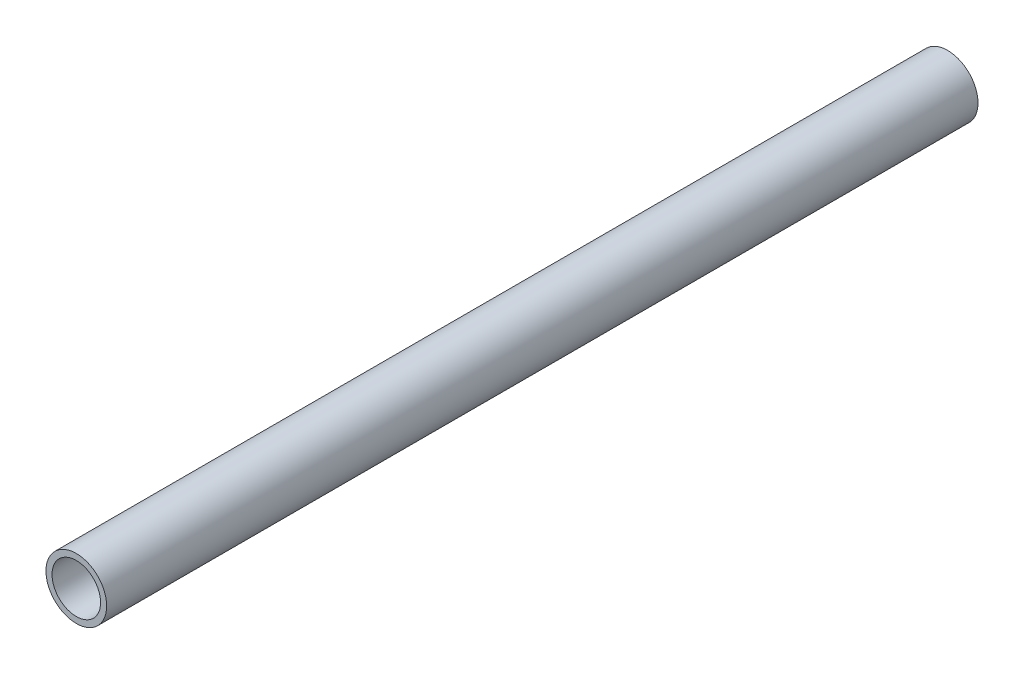
ISO-10303-21;
HEADER;
FILE_DESCRIPTION(('STEP AP214'),'2;1');
FILE_NAME('part.step','',(''),(''),'','','');
FILE_SCHEMA(('AUTOMOTIVE_DESIGN { 1 0 10303 214 1 1 1 1 }'));
ENDSEC;
DATA;
#1=APPLICATION_CONTEXT('core data for automotive mechanical design processes');
#2=APPLICATION_PROTOCOL_DEFINITION('international standard','automotive_design',2000,#1);
#3=PRODUCT_CONTEXT('',#1,'mechanical');
#4=PRODUCT('Part','Part','',(#3));
#5=PRODUCT_RELATED_PRODUCT_CATEGORY('part','',(#4));
#6=PRODUCT_DEFINITION_FORMATION('','',#4);
#7=PRODUCT_DEFINITION_CONTEXT('part definition',#1,'design');
#8=PRODUCT_DEFINITION('design','',#6,#7);
#9=PRODUCT_DEFINITION_SHAPE('','',#8);
#10=(LENGTH_UNIT() NAMED_UNIT(*) SI_UNIT(.MILLI.,.METRE.));
#11=(NAMED_UNIT(*) PLANE_ANGLE_UNIT() SI_UNIT($,.RADIAN.));
#12=(NAMED_UNIT(*) SI_UNIT($,.STERADIAN.) SOLID_ANGLE_UNIT());
#13=UNCERTAINTY_MEASURE_WITH_UNIT(LENGTH_MEASURE(1.E-05),#10,'distance_accuracy_value','');
#14=(GEOMETRIC_REPRESENTATION_CONTEXT(3) GLOBAL_UNCERTAINTY_ASSIGNED_CONTEXT((#13)) GLOBAL_UNIT_ASSIGNED_CONTEXT((#10,
#11,#12)) REPRESENTATION_CONTEXT('',''));
#15=CARTESIAN_POINT('',(0.,0.,0.));
#16=DIRECTION('',(0.,0.,1.));
#17=DIRECTION('',(1.,0.,0.));
#18=AXIS2_PLACEMENT_3D('',#15,#16,#17);
#19=CARTESIAN_POINT('',(0.,0.,143.5));
#20=DIRECTION('',(0.,0.,1.));
#21=DIRECTION('',(1.,0.,0.));
#22=AXIS2_PLACEMENT_3D('',#19,#20,#21);
#23=PLANE('',#22);
#24=CARTESIAN_POINT('',(0.,0.,143.5));
#25=DIRECTION('',(0.,0.,1.));
#26=DIRECTION('',(1.,0.,0.));
#27=AXIS2_PLACEMENT_3D('',#24,#25,#26);
#28=CIRCLE('',#27,5.);
#29=CARTESIAN_POINT('',(5.,0.,143.5));
#30=VERTEX_POINT('',#29);
#31=EDGE_CURVE('E10',#30,#30,#28,.T.);
#32=ORIENTED_EDGE('',*,*,#31,.T.);
#33=EDGE_LOOP('',(#32));
#34=FACE_BOUND('',#33,.T.);
#35=CARTESIAN_POINT('',(0.,0.,143.5));
#36=DIRECTION('',(0.,0.,1.));
#37=DIRECTION('',(1.,0.,0.));
#38=AXIS2_PLACEMENT_3D('',#35,#36,#37);
#39=CIRCLE('',#38,4.);
#40=CARTESIAN_POINT('',(4.,0.,143.5));
#41=VERTEX_POINT('',#40);
#42=EDGE_CURVE('E44',#41,#41,#39,.T.);
#43=ORIENTED_EDGE('',*,*,#42,.F.);
#44=EDGE_LOOP('',(#43));
#45=FACE_BOUND('',#44,.T.);
#46=ADVANCED_FACE('F33',(#34,#45),#23,.T.);
#47=CARTESIAN_POINT('',(0.,0.,0.));
#48=DIRECTION('',(0.,0.,1.));
#49=DIRECTION('',(1.,0.,0.));
#50=AXIS2_PLACEMENT_3D('',#47,#48,#49);
#51=PLANE('',#50);
#52=CARTESIAN_POINT('',(0.,0.,0.));
#53=DIRECTION('',(0.,0.,1.));
#54=DIRECTION('',(1.,0.,0.));
#55=AXIS2_PLACEMENT_3D('',#52,#53,#54);
#56=CIRCLE('',#55,5.);
#57=CARTESIAN_POINT('',(5.,0.,0.));
#58=VERTEX_POINT('',#57);
#59=EDGE_CURVE('E37',#58,#58,#56,.T.);
#60=ORIENTED_EDGE('',*,*,#59,.F.);
#61=EDGE_LOOP('',(#60));
#62=FACE_BOUND('',#61,.T.);
#63=CARTESIAN_POINT('',(0.,0.,0.));
#64=DIRECTION('',(0.,0.,1.));
#65=DIRECTION('',(1.,0.,0.));
#66=AXIS2_PLACEMENT_3D('',#63,#64,#65);
#67=CIRCLE('',#66,4.);
#68=CARTESIAN_POINT('',(4.,0.,0.));
#69=VERTEX_POINT('',#68);
#70=EDGE_CURVE('E46',#69,#69,#67,.T.);
#71=ORIENTED_EDGE('',*,*,#70,.T.);
#72=EDGE_LOOP('',(#71));
#73=FACE_BOUND('',#72,.T.);
#74=ADVANCED_FACE('F56',(#62,#73),#51,.F.);
#75=CARTESIAN_POINT('',(0.,0.,143.5));
#76=DIRECTION('',(0.,0.,-1.));
#77=DIRECTION('',(-1.,0.,0.));
#78=AXIS2_PLACEMENT_3D('',#75,#76,#77);
#79=CYLINDRICAL_SURFACE('',#78,5.);
#80=ORIENTED_EDGE('',*,*,#31,.F.);
#81=EDGE_LOOP('',(#80));
#82=FACE_BOUND('',#81,.T.);
#83=ORIENTED_EDGE('',*,*,#59,.T.);
#84=EDGE_LOOP('',(#83));
#85=FACE_BOUND('',#84,.T.);
#86=ADVANCED_FACE('F35',(#82,#85),#79,.T.);
#87=CARTESIAN_POINT('',(0.,0.,143.5));
#88=DIRECTION('',(0.,0.,-1.));
#89=DIRECTION('',(-1.,0.,0.));
#90=AXIS2_PLACEMENT_3D('',#87,#88,#89);
#91=CYLINDRICAL_SURFACE('',#90,4.);
#92=ORIENTED_EDGE('',*,*,#42,.T.);
#93=EDGE_LOOP('',(#92));
#94=FACE_BOUND('',#93,.T.);
#95=ORIENTED_EDGE('',*,*,#70,.F.);
#96=EDGE_LOOP('',(#95));
#97=FACE_BOUND('',#96,.T.);
#98=ADVANCED_FACE('F52',(#94,#97),#91,.F.);
#99=CLOSED_SHELL('',(#46,#74,#86,#98));
#100=MANIFOLD_SOLID_BREP('B2',#99);
#101=ADVANCED_BREP_SHAPE_REPRESENTATION('',(#18,#100),#14);
#102=SHAPE_DEFINITION_REPRESENTATION(#9,#101);
ENDSEC;
END-ISO-10303-21;
